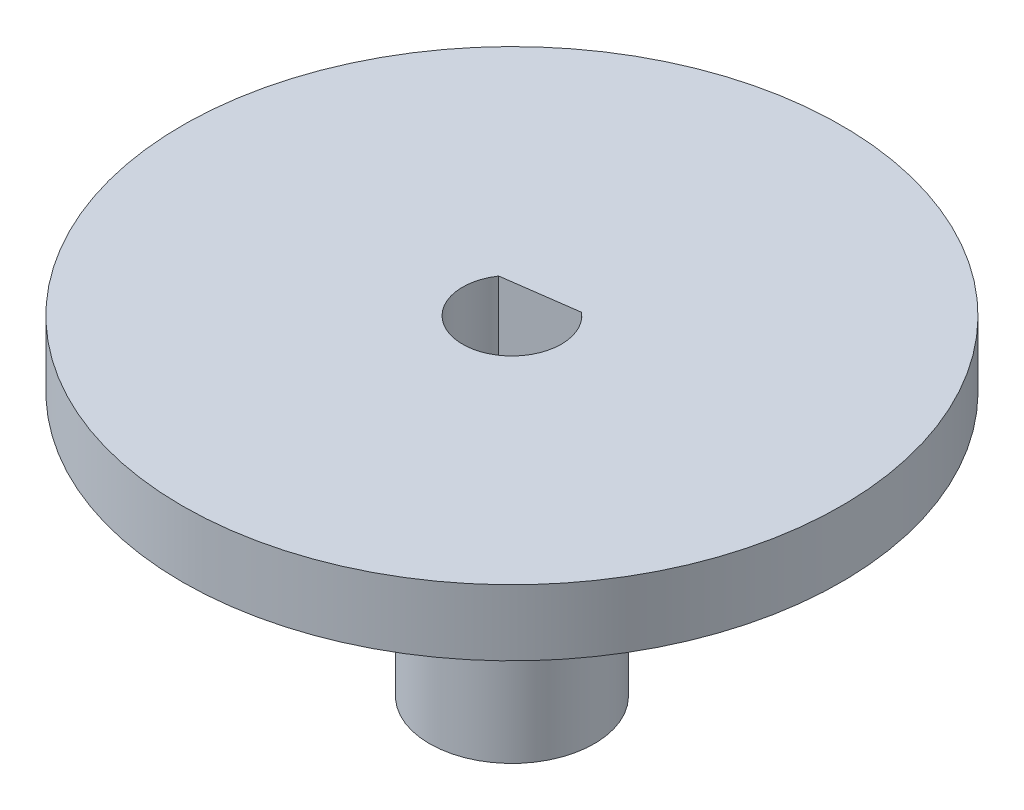
ISO-10303-21;
HEADER;
FILE_DESCRIPTION(('STEP AP214'),'2;1');
FILE_NAME('part.step','',(''),(''),'','','');
FILE_SCHEMA(('AUTOMOTIVE_DESIGN { 1 0 10303 214 1 1 1 1 }'));
ENDSEC;
DATA;
#1=APPLICATION_CONTEXT('core data for automotive mechanical design processes');
#2=APPLICATION_PROTOCOL_DEFINITION('international standard','automotive_design',2000,#1);
#3=PRODUCT_CONTEXT('',#1,'mechanical');
#4=PRODUCT('Part','Part','',(#3));
#5=PRODUCT_RELATED_PRODUCT_CATEGORY('part','',(#4));
#6=PRODUCT_DEFINITION_FORMATION('','',#4);
#7=PRODUCT_DEFINITION_CONTEXT('part definition',#1,'design');
#8=PRODUCT_DEFINITION('design','',#6,#7);
#9=PRODUCT_DEFINITION_SHAPE('','',#8);
#10=(LENGTH_UNIT() NAMED_UNIT(*) SI_UNIT(.MILLI.,.METRE.));
#11=(NAMED_UNIT(*) PLANE_ANGLE_UNIT() SI_UNIT($,.RADIAN.));
#12=(NAMED_UNIT(*) SI_UNIT($,.STERADIAN.) SOLID_ANGLE_UNIT());
#13=UNCERTAINTY_MEASURE_WITH_UNIT(LENGTH_MEASURE(1.E-05),#10,'distance_accuracy_value','');
#14=(GEOMETRIC_REPRESENTATION_CONTEXT(3) GLOBAL_UNCERTAINTY_ASSIGNED_CONTEXT((#13)) GLOBAL_UNIT_ASSIGNED_CONTEXT((#10,
#11,#12)) REPRESENTATION_CONTEXT('',''));
#15=CARTESIAN_POINT('',(0.,0.,0.));
#16=DIRECTION('',(0.,0.,1.));
#17=DIRECTION('',(1.,0.,0.));
#18=AXIS2_PLACEMENT_3D('',#15,#16,#17);
#19=CARTESIAN_POINT('',(0.,10.,0.));
#20=DIRECTION('',(0.,-1.,0.));
#21=DIRECTION('',(0.,0.,-1.));
#22=AXIS2_PLACEMENT_3D('',#19,#20,#21);
#23=CYLINDRICAL_SURFACE('',#22,2.5000000000002);
#24=CARTESIAN_POINT('',(0.,0.,0.));
#25=DIRECTION('',(0.,1.,0.));
#26=DIRECTION('',(0.,0.,1.));
#27=AXIS2_PLACEMENT_3D('',#24,#25,#26);
#28=CIRCLE('',#27,2.5000000000002);
#29=CARTESIAN_POINT('',(0.,0.,2.5000000000002));
#30=VERTEX_POINT('',#29);
#31=EDGE_CURVE('E70',#30,#30,#28,.T.);
#32=ORIENTED_EDGE('',*,*,#31,.T.);
#33=EDGE_LOOP('',(#32));
#34=FACE_BOUND('',#33,.T.);
#35=CARTESIAN_POINT('',(0.,8.,0.));
#36=DIRECTION('',(0.,1.,0.));
#37=DIRECTION('',(0.,0.,1.));
#38=AXIS2_PLACEMENT_3D('',#35,#36,#37);
#39=CIRCLE('',#38,2.5000000000002);
#40=CARTESIAN_POINT('',(0.,8.,2.5000000000002));
#41=VERTEX_POINT('',#40);
#42=EDGE_CURVE('E11',#41,#41,#39,.T.);
#43=ORIENTED_EDGE('',*,*,#42,.F.);
#44=EDGE_LOOP('',(#43));
#45=FACE_BOUND('',#44,.T.);
#46=ADVANCED_FACE('F37',(#34,#45),#23,.T.);
#47=CARTESIAN_POINT('',(0.,10.,0.));
#48=DIRECTION('',(0.,-1.,0.));
#49=DIRECTION('',(0.,0.,-1.));
#50=AXIS2_PLACEMENT_3D('',#47,#48,#49);
#51=CYLINDRICAL_SURFACE('',#50,1.4999483478744);
#52=CARTESIAN_POINT('',(0.,0.,0.));
#53=DIRECTION('',(0.,1.,0.));
#54=DIRECTION('',(0.,0.,1.));
#55=AXIS2_PLACEMENT_3D('',#52,#53,#54);
#56=CIRCLE('',#55,1.4999483478744);
#57=CARTESIAN_POINT('',(0.968768207565023,0.,-1.1451345799959));
#58=VERTEX_POINT('',#57);
#59=CARTESIAN_POINT('',(-1.24237832859475,0.,-0.840441035962218));
#60=VERTEX_POINT('',#59);
#61=EDGE_CURVE('E71',#58,#60,#56,.F.);
#62=ORIENTED_EDGE('',*,*,#61,.T.);
#63=DIRECTION('',(0.,-1.,0.));
#64=VECTOR('',#63,1.);
#65=CARTESIAN_POINT('',(-1.24237832859475,10.,-0.840441035962218));
#66=LINE('',#65,#64);
#67=CARTESIAN_POINT('',(-1.24237832859475,10.,-0.840441035962218));
#68=VERTEX_POINT('',#67);
#69=EDGE_CURVE('E46',#68,#60,#66,.T.);
#70=ORIENTED_EDGE('',*,*,#69,.F.);
#71=CARTESIAN_POINT('',(0.,10.,0.));
#72=DIRECTION('',(0.,1.,0.));
#73=DIRECTION('',(0.,0.,1.));
#74=AXIS2_PLACEMENT_3D('',#71,#72,#73);
#75=CIRCLE('',#74,1.4999483478744);
#76=CARTESIAN_POINT('',(0.968768207565023,10.,-1.1451345799959));
#77=VERTEX_POINT('',#76);
#78=EDGE_CURVE('E74',#77,#68,#75,.F.);
#79=ORIENTED_EDGE('',*,*,#78,.F.);
#80=DIRECTION('',(0.,-1.,0.));
#81=VECTOR('',#80,1.);
#82=CARTESIAN_POINT('',(0.968768207565023,10.,-1.1451345799959));
#83=LINE('',#82,#81);
#84=EDGE_CURVE('E66',#77,#58,#83,.T.);
#85=ORIENTED_EDGE('',*,*,#84,.T.);
#86=EDGE_LOOP('',(#62,#70,#79,#85));
#87=FACE_BOUND('',#86,.T.);
#88=ADVANCED_FACE('F39',(#87),#51,.F.);
#89=CARTESIAN_POINT('',(-0.136805060514863,10.,-0.992787807979058));
#90=DIRECTION('',(-0.136508935060685,0.,-0.99063883966287));
#91=DIRECTION('',(-0.99063883966287,0.,0.136508935060685));
#92=AXIS2_PLACEMENT_3D('',#89,#90,#91);
#93=PLANE('',#92);
#94=DIRECTION('',(0.99063883966287,0.,-0.136508935060685));
#95=VECTOR('',#94,1.);
#96=CARTESIAN_POINT('',(-0.136805060514863,0.,-0.992787807979058));
#97=LINE('',#96,#95);
#98=EDGE_CURVE('E61',#60,#58,#97,.T.);
#99=ORIENTED_EDGE('',*,*,#98,.T.);
#100=ORIENTED_EDGE('',*,*,#84,.F.);
#101=DIRECTION('',(0.99063883966287,0.,-0.136508935060685));
#102=VECTOR('',#101,1.);
#103=CARTESIAN_POINT('',(-0.136805060514863,10.,-0.992787807979058));
#104=LINE('',#103,#102);
#105=EDGE_CURVE('E53',#68,#77,#104,.T.);
#106=ORIENTED_EDGE('',*,*,#105,.F.);
#107=ORIENTED_EDGE('',*,*,#69,.T.);
#108=EDGE_LOOP('',(#99,#100,#106,#107));
#109=FACE_BOUND('',#108,.T.);
#110=ADVANCED_FACE('F65',(#109),#93,.F.);
#111=CARTESIAN_POINT('',(0.,10.,0.));
#112=DIRECTION('',(0.,1.,0.));
#113=DIRECTION('',(0.,0.,1.));
#114=AXIS2_PLACEMENT_3D('',#111,#112,#113);
#115=PLANE('',#114);
#116=ORIENTED_EDGE('',*,*,#78,.T.);
#117=ORIENTED_EDGE('',*,*,#105,.T.);
#118=EDGE_LOOP('',(#116,#117));
#119=FACE_BOUND('',#118,.T.);
#120=CARTESIAN_POINT('',(0.,10.,0.));
#121=DIRECTION('',(0.,1.,0.));
#122=DIRECTION('',(0.,0.,1.));
#123=AXIS2_PLACEMENT_3D('',#120,#121,#122);
#124=CIRCLE('',#123,10.0000000000002);
#125=CARTESIAN_POINT('',(0.,10.,10.0000000000002));
#126=VERTEX_POINT('',#125);
#127=EDGE_CURVE('E81',#126,#126,#124,.T.);
#128=ORIENTED_EDGE('',*,*,#127,.T.);
#129=EDGE_LOOP('',(#128));
#130=FACE_BOUND('',#129,.T.);
#131=ADVANCED_FACE('F93',(#119,#130),#115,.T.);
#132=CARTESIAN_POINT('',(0.,0.,0.));
#133=DIRECTION('',(0.,1.,0.));
#134=DIRECTION('',(0.,0.,1.));
#135=AXIS2_PLACEMENT_3D('',#132,#133,#134);
#136=PLANE('',#135);
#137=ORIENTED_EDGE('',*,*,#61,.F.);
#138=ORIENTED_EDGE('',*,*,#98,.F.);
#139=EDGE_LOOP('',(#137,#138));
#140=FACE_BOUND('',#139,.T.);
#141=ORIENTED_EDGE('',*,*,#31,.F.);
#142=EDGE_LOOP('',(#141));
#143=FACE_BOUND('',#142,.T.);
#144=ADVANCED_FACE('F76',(#140,#143),#136,.F.);
#145=CARTESIAN_POINT('',(0.,8.,0.));
#146=DIRECTION('',(0.,1.,0.));
#147=DIRECTION('',(0.,0.,1.));
#148=AXIS2_PLACEMENT_3D('',#145,#146,#147);
#149=CYLINDRICAL_SURFACE('',#148,10.0000000000002);
#150=CARTESIAN_POINT('',(0.,8.,0.));
#151=DIRECTION('',(0.,1.,0.));
#152=DIRECTION('',(0.,0.,1.));
#153=AXIS2_PLACEMENT_3D('',#150,#151,#152);
#154=CIRCLE('',#153,10.0000000000002);
#155=CARTESIAN_POINT('',(0.,8.,10.0000000000002));
#156=VERTEX_POINT('',#155);
#157=EDGE_CURVE('E78',#156,#156,#154,.T.);
#158=ORIENTED_EDGE('',*,*,#157,.T.);
#159=EDGE_LOOP('',(#158));
#160=FACE_BOUND('',#159,.T.);
#161=ORIENTED_EDGE('',*,*,#127,.F.);
#162=EDGE_LOOP('',(#161));
#163=FACE_BOUND('',#162,.T.);
#164=ADVANCED_FACE('F95',(#160,#163),#149,.T.);
#165=CARTESIAN_POINT('',(0.,8.,0.));
#166=DIRECTION('',(0.,1.,0.));
#167=DIRECTION('',(0.,0.,1.));
#168=AXIS2_PLACEMENT_3D('',#165,#166,#167);
#169=PLANE('',#168);
#170=ORIENTED_EDGE('',*,*,#42,.T.);
#171=EDGE_LOOP('',(#170));
#172=FACE_BOUND('',#171,.T.);
#173=ORIENTED_EDGE('',*,*,#157,.F.);
#174=EDGE_LOOP('',(#173));
#175=FACE_BOUND('',#174,.T.);
#176=ADVANCED_FACE('F97',(#172,#175),#169,.F.);
#177=CLOSED_SHELL('',(#46,#88,#110,#131,#144,#164,#176));
#178=MANIFOLD_SOLID_BREP('B2',#177);
#179=ADVANCED_BREP_SHAPE_REPRESENTATION('',(#18,#178),#14);
#180=SHAPE_DEFINITION_REPRESENTATION(#9,#179);
ENDSEC;
END-ISO-10303-21;
